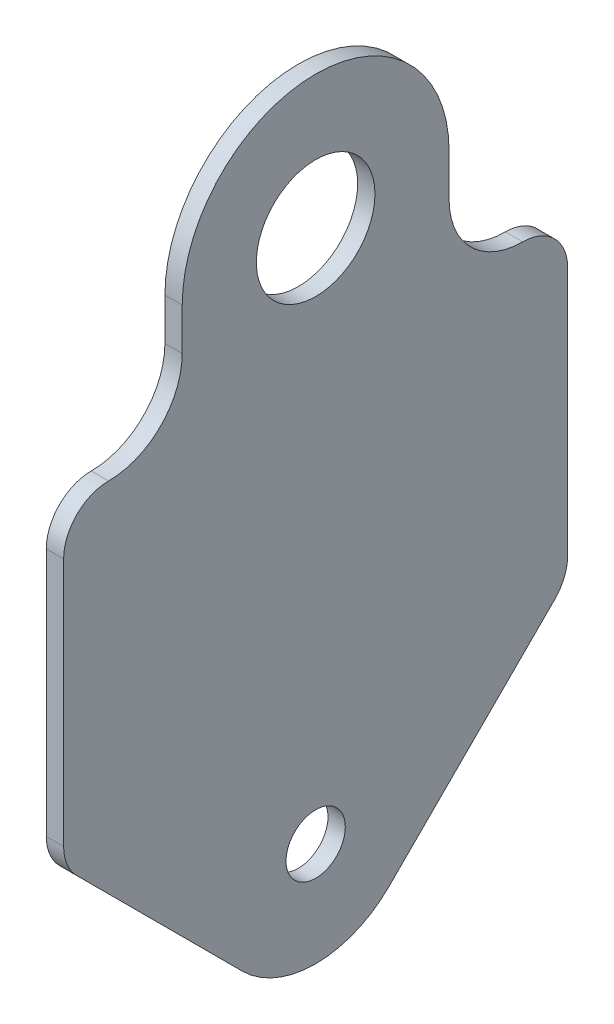
ISO-10303-21;
HEADER;
FILE_DESCRIPTION(('STEP AP214'),'2;1');
FILE_NAME('part.step','',(''),(''),'','','');
FILE_SCHEMA(('AUTOMOTIVE_DESIGN { 1 0 10303 214 1 1 1 1 }'));
ENDSEC;
DATA;
#1=APPLICATION_CONTEXT('core data for automotive mechanical design processes');
#2=APPLICATION_PROTOCOL_DEFINITION('international standard','automotive_design',2000,#1);
#3=PRODUCT_CONTEXT('',#1,'mechanical');
#4=PRODUCT('Part','Part','',(#3));
#5=PRODUCT_RELATED_PRODUCT_CATEGORY('part','',(#4));
#6=PRODUCT_DEFINITION_FORMATION('','',#4);
#7=PRODUCT_DEFINITION_CONTEXT('part definition',#1,'design');
#8=PRODUCT_DEFINITION('design','',#6,#7);
#9=PRODUCT_DEFINITION_SHAPE('','',#8);
#10=(LENGTH_UNIT() NAMED_UNIT(*) SI_UNIT(.MILLI.,.METRE.));
#11=(NAMED_UNIT(*) PLANE_ANGLE_UNIT() SI_UNIT($,.RADIAN.));
#12=(NAMED_UNIT(*) SI_UNIT($,.STERADIAN.) SOLID_ANGLE_UNIT());
#13=UNCERTAINTY_MEASURE_WITH_UNIT(LENGTH_MEASURE(1.E-05),#10,'distance_accuracy_value','');
#14=(GEOMETRIC_REPRESENTATION_CONTEXT(3) GLOBAL_UNCERTAINTY_ASSIGNED_CONTEXT((#13)) GLOBAL_UNIT_ASSIGNED_CONTEXT((#10,
#11,#12)) REPRESENTATION_CONTEXT('',''));
#15=CARTESIAN_POINT('',(0.,0.,0.));
#16=DIRECTION('',(0.,0.,1.));
#17=DIRECTION('',(1.,0.,0.));
#18=AXIS2_PLACEMENT_3D('',#15,#16,#17);
#19=CARTESIAN_POINT('',(2.3368,0.,0.));
#20=DIRECTION('',(-1.,0.,0.));
#21=DIRECTION('',(0.,0.,1.));
#22=AXIS2_PLACEMENT_3D('',#19,#20,#21);
#23=PLANE('',#22);
#24=CARTESIAN_POINT('',(2.3368,0.,0.));
#25=DIRECTION('',(1.,0.,0.));
#26=DIRECTION('',(0.,0.,1.));
#27=AXIS2_PLACEMENT_3D('',#24,#25,#26);
#28=CIRCLE('',#27,18.);
#29=CARTESIAN_POINT('',(2.3368,0.,-18.));
#30=VERTEX_POINT('',#29);
#31=CARTESIAN_POINT('',(2.3368,0.,18.));
#32=VERTEX_POINT('',#31);
#33=EDGE_CURVE('E193',#30,#32,#28,.T.);
#34=ORIENTED_EDGE('',*,*,#33,.T.);
#35=DIRECTION('',(0.,-1.,0.));
#36=VECTOR('',#35,1.);
#37=CARTESIAN_POINT('',(2.3368,0.,18.));
#38=LINE('',#37,#36);
#39=CARTESIAN_POINT('',(2.3368,-5.64053844801724,18.));
#40=VERTEX_POINT('',#39);
#41=EDGE_CURVE('E111',#32,#40,#38,.T.);
#42=ORIENTED_EDGE('',*,*,#41,.T.);
#43=CARTESIAN_POINT('',(2.3368,-5.64053844801724,27.9362546884231));
#44=DIRECTION('',(-1.,0.,0.));
#45=DIRECTION('',(0.,0.,-1.));
#46=AXIS2_PLACEMENT_3D('',#43,#44,#45);
#47=CIRCLE('',#46,9.93625468842306);
#48=CARTESIAN_POINT('',(2.3368,-15.5767931364403,27.9362546884231));
#49=VERTEX_POINT('',#48);
#50=EDGE_CURVE('E226',#40,#49,#47,.T.);
#51=ORIENTED_EDGE('',*,*,#50,.T.);
#52=CARTESIAN_POINT('',(2.3368,-21.6405384480172,27.9362546884231));
#53=DIRECTION('',(1.,0.,0.));
#54=DIRECTION('',(0.,0.,-1.));
#55=AXIS2_PLACEMENT_3D('',#52,#53,#54);
#56=CIRCLE('',#55,6.06374531157695);
#57=CARTESIAN_POINT('',(2.3368,-21.6405384480172,34.));
#58=VERTEX_POINT('',#57);
#59=EDGE_CURVE('E245',#49,#58,#56,.T.);
#60=ORIENTED_EDGE('',*,*,#59,.T.);
#61=DIRECTION('',(0.,-1.,0.));
#62=VECTOR('',#61,1.);
#63=CARTESIAN_POINT('',(2.3368,-21.6405384480172,34.));
#64=LINE('',#63,#62);
#65=CARTESIAN_POINT('',(2.3368,-55.2473043263916,34.));
#66=VERTEX_POINT('',#65);
#67=EDGE_CURVE('E242',#58,#66,#64,.T.);
#68=ORIENTED_EDGE('',*,*,#67,.T.);
#69=CARTESIAN_POINT('',(2.3368,-55.2473043263916,27.9362546884231));
#70=DIRECTION('',(1.,0.,0.));
#71=DIRECTION('',(0.,0.,-1.));
#72=AXIS2_PLACEMENT_3D('',#69,#70,#71);
#73=CIRCLE('',#72,6.06374531157696);
#74=CARTESIAN_POINT('',(2.3368,-59.5350197555958,32.2239701176273));
#75=VERTEX_POINT('',#74);
#76=EDGE_CURVE('E244',#66,#75,#73,.T.);
#77=ORIENTED_EDGE('',*,*,#76,.T.);
#78=DIRECTION('',(0.,-0.707106781186551,-0.707106781186544));
#79=VECTOR('',#78,1.);
#80=CARTESIAN_POINT('',(2.3368,-59.5350197555958,32.2239701176273));
#81=LINE('',#80,#79);
#82=CARTESIAN_POINT('',(2.3368,-81.8594949366116,9.89949493661172));
#83=VERTEX_POINT('',#82);
#84=EDGE_CURVE('E247',#75,#83,#81,.T.);
#85=ORIENTED_EDGE('',*,*,#84,.T.);
#86=CARTESIAN_POINT('',(2.3368,-71.96,0.));
#87=DIRECTION('',(1.,0.,0.));
#88=DIRECTION('',(0.,0.,-1.));
#89=AXIS2_PLACEMENT_3D('',#86,#87,#88);
#90=CIRCLE('',#89,14.);
#91=CARTESIAN_POINT('',(2.3368,-81.8594949366116,-9.89949493661172));
#92=VERTEX_POINT('',#91);
#93=EDGE_CURVE('E253',#83,#92,#90,.T.);
#94=ORIENTED_EDGE('',*,*,#93,.T.);
#95=DIRECTION('',(0.,0.707106781186551,-0.707106781186543));
#96=VECTOR('',#95,1.);
#97=CARTESIAN_POINT('',(2.3368,-81.8594949366116,-9.89949493661171));
#98=LINE('',#97,#96);
#99=CARTESIAN_POINT('',(2.3368,-59.5350197555958,-32.2239701176273));
#100=VERTEX_POINT('',#99);
#101=EDGE_CURVE('E255',#92,#100,#98,.T.);
#102=ORIENTED_EDGE('',*,*,#101,.T.);
#103=CARTESIAN_POINT('',(2.3368,-55.2473043263916,-27.9362546884231));
#104=DIRECTION('',(1.,0.,0.));
#105=DIRECTION('',(0.,0.,1.));
#106=AXIS2_PLACEMENT_3D('',#103,#104,#105);
#107=CIRCLE('',#106,6.06374531157695);
#108=CARTESIAN_POINT('',(2.3368,-55.2473043263916,-34.));
#109=VERTEX_POINT('',#108);
#110=EDGE_CURVE('E257',#100,#109,#107,.T.);
#111=ORIENTED_EDGE('',*,*,#110,.T.);
#112=DIRECTION('',(0.,1.,0.));
#113=VECTOR('',#112,1.);
#114=CARTESIAN_POINT('',(2.3368,-21.6405384480172,-34.));
#115=LINE('',#114,#113);
#116=CARTESIAN_POINT('',(2.3368,-21.6405384480172,-34.));
#117=VERTEX_POINT('',#116);
#118=EDGE_CURVE('E148',#109,#117,#115,.T.);
#119=ORIENTED_EDGE('',*,*,#118,.T.);
#120=CARTESIAN_POINT('',(2.3368,-21.6405384480172,-27.936254688423));
#121=DIRECTION('',(1.,0.,0.));
#122=DIRECTION('',(0.,0.,1.));
#123=AXIS2_PLACEMENT_3D('',#120,#121,#122);
#124=CIRCLE('',#123,6.06374531157695);
#125=CARTESIAN_POINT('',(2.3368,-15.5767931364403,-27.936254688423));
#126=VERTEX_POINT('',#125);
#127=EDGE_CURVE('E142',#117,#126,#124,.T.);
#128=ORIENTED_EDGE('',*,*,#127,.T.);
#129=CARTESIAN_POINT('',(2.3368,-5.64053844801724,-27.936254688423));
#130=DIRECTION('',(-1.,0.,0.));
#131=DIRECTION('',(0.,0.,-1.));
#132=AXIS2_PLACEMENT_3D('',#129,#130,#131);
#133=CIRCLE('',#132,9.93625468842306);
#134=CARTESIAN_POINT('',(2.3368,-5.64053844801724,-18.));
#135=VERTEX_POINT('',#134);
#136=EDGE_CURVE('E146',#126,#135,#133,.T.);
#137=ORIENTED_EDGE('',*,*,#136,.T.);
#138=DIRECTION('',(0.,1.,0.));
#139=VECTOR('',#138,1.);
#140=CARTESIAN_POINT('',(2.3368,0.,-18.));
#141=LINE('',#140,#139);
#142=EDGE_CURVE('E50',#135,#30,#141,.T.);
#143=ORIENTED_EDGE('',*,*,#142,.T.);
#144=EDGE_LOOP('',(#34,#42,#51,#60,#68,#77,#85,#94,#102,#111,#119,#128,#137,#143));
#145=FACE_BOUND('',#144,.T.);
#146=CARTESIAN_POINT('',(2.3368,0.,0.));
#147=DIRECTION('',(1.,0.,0.));
#148=DIRECTION('',(0.,0.,-1.));
#149=AXIS2_PLACEMENT_3D('',#146,#147,#148);
#150=CIRCLE('',#149,8.);
#151=CARTESIAN_POINT('',(2.3368,0.,-8.));
#152=VERTEX_POINT('',#151);
#153=EDGE_CURVE('E170',#152,#152,#150,.T.);
#154=ORIENTED_EDGE('',*,*,#153,.F.);
#155=EDGE_LOOP('',(#154));
#156=FACE_BOUND('',#155,.T.);
#157=CARTESIAN_POINT('',(2.3368,-71.96,0.));
#158=DIRECTION('',(1.,0.,0.));
#159=DIRECTION('',(0.,0.,-1.));
#160=AXIS2_PLACEMENT_3D('',#157,#158,#159);
#161=CIRCLE('',#160,4.);
#162=CARTESIAN_POINT('',(2.3368,-71.96,-4.00000000000001));
#163=VERTEX_POINT('',#162);
#164=EDGE_CURVE('E298',#163,#163,#161,.T.);
#165=ORIENTED_EDGE('',*,*,#164,.F.);
#166=EDGE_LOOP('',(#165));
#167=FACE_BOUND('',#166,.T.);
#168=ADVANCED_FACE('F33',(#145,#156,#167),#23,.F.);
#169=CARTESIAN_POINT('',(0.,0.,0.));
#170=DIRECTION('',(-1.,0.,0.));
#171=DIRECTION('',(0.,0.,1.));
#172=AXIS2_PLACEMENT_3D('',#169,#170,#171);
#173=PLANE('',#172);
#174=CARTESIAN_POINT('',(0.,0.,0.));
#175=DIRECTION('',(1.,0.,0.));
#176=DIRECTION('',(0.,0.,-1.));
#177=AXIS2_PLACEMENT_3D('',#174,#175,#176);
#178=CIRCLE('',#177,8.);
#179=CARTESIAN_POINT('',(0.,0.,-8.));
#180=VERTEX_POINT('',#179);
#181=EDGE_CURVE('E303',#180,#180,#178,.T.);
#182=ORIENTED_EDGE('',*,*,#181,.T.);
#183=EDGE_LOOP('',(#182));
#184=FACE_BOUND('',#183,.T.);
#185=CARTESIAN_POINT('',(0.,0.,0.));
#186=DIRECTION('',(1.,0.,0.));
#187=DIRECTION('',(0.,0.,1.));
#188=AXIS2_PLACEMENT_3D('',#185,#186,#187);
#189=CIRCLE('',#188,18.);
#190=CARTESIAN_POINT('',(0.,0.,-18.));
#191=VERTEX_POINT('',#190);
#192=CARTESIAN_POINT('',(0.,0.,18.));
#193=VERTEX_POINT('',#192);
#194=EDGE_CURVE('E166',#191,#193,#189,.T.);
#195=ORIENTED_EDGE('',*,*,#194,.F.);
#196=DIRECTION('',(0.,1.,0.));
#197=VECTOR('',#196,1.);
#198=CARTESIAN_POINT('',(0.,0.,-18.));
#199=LINE('',#198,#197);
#200=CARTESIAN_POINT('',(0.,-5.64053844801724,-18.));
#201=VERTEX_POINT('',#200);
#202=EDGE_CURVE('E103',#201,#191,#199,.T.);
#203=ORIENTED_EDGE('',*,*,#202,.F.);
#204=CARTESIAN_POINT('',(0.,-5.64053844801724,-27.936254688423));
#205=DIRECTION('',(-1.,0.,0.));
#206=DIRECTION('',(0.,0.,-1.));
#207=AXIS2_PLACEMENT_3D('',#204,#205,#206);
#208=CIRCLE('',#207,9.93625468842306);
#209=CARTESIAN_POINT('',(0.,-15.5767931364403,-27.936254688423));
#210=VERTEX_POINT('',#209);
#211=EDGE_CURVE('E97',#210,#201,#208,.T.);
#212=ORIENTED_EDGE('',*,*,#211,.F.);
#213=CARTESIAN_POINT('',(0.,-21.6405384480172,-27.936254688423));
#214=DIRECTION('',(1.,0.,0.));
#215=DIRECTION('',(0.,0.,1.));
#216=AXIS2_PLACEMENT_3D('',#213,#214,#215);
#217=CIRCLE('',#216,6.06374531157695);
#218=CARTESIAN_POINT('',(0.,-21.6405384480172,-34.));
#219=VERTEX_POINT('',#218);
#220=EDGE_CURVE('E156',#219,#210,#217,.T.);
#221=ORIENTED_EDGE('',*,*,#220,.F.);
#222=DIRECTION('',(0.,1.,0.));
#223=VECTOR('',#222,1.);
#224=CARTESIAN_POINT('',(0.,-21.6405384480172,-34.));
#225=LINE('',#224,#223);
#226=CARTESIAN_POINT('',(0.,-55.2473043263916,-34.));
#227=VERTEX_POINT('',#226);
#228=EDGE_CURVE('E188',#227,#219,#225,.T.);
#229=ORIENTED_EDGE('',*,*,#228,.F.);
#230=CARTESIAN_POINT('',(0.,-55.2473043263916,-27.9362546884231));
#231=DIRECTION('',(1.,0.,0.));
#232=DIRECTION('',(0.,0.,1.));
#233=AXIS2_PLACEMENT_3D('',#230,#231,#232);
#234=CIRCLE('',#233,6.06374531157695);
#235=CARTESIAN_POINT('',(0.,-59.5350197555958,-32.2239701176273));
#236=VERTEX_POINT('',#235);
#237=EDGE_CURVE('E186',#236,#227,#234,.T.);
#238=ORIENTED_EDGE('',*,*,#237,.F.);
#239=DIRECTION('',(0.,0.707106781186551,-0.707106781186543));
#240=VECTOR('',#239,1.);
#241=CARTESIAN_POINT('',(0.,-81.8594949366116,-9.89949493661171));
#242=LINE('',#241,#240);
#243=CARTESIAN_POINT('',(0.,-81.8594949366116,-9.89949493661172));
#244=VERTEX_POINT('',#243);
#245=EDGE_CURVE('E184',#244,#236,#242,.T.);
#246=ORIENTED_EDGE('',*,*,#245,.F.);
#247=CARTESIAN_POINT('',(0.,-71.96,0.));
#248=DIRECTION('',(1.,0.,0.));
#249=DIRECTION('',(0.,0.,-1.));
#250=AXIS2_PLACEMENT_3D('',#247,#248,#249);
#251=CIRCLE('',#250,14.);
#252=CARTESIAN_POINT('',(0.,-81.8594949366116,9.89949493661172));
#253=VERTEX_POINT('',#252);
#254=EDGE_CURVE('E182',#253,#244,#251,.T.);
#255=ORIENTED_EDGE('',*,*,#254,.F.);
#256=DIRECTION('',(0.,-0.707106781186551,-0.707106781186544));
#257=VECTOR('',#256,1.);
#258=CARTESIAN_POINT('',(0.,-59.5350197555958,32.2239701176273));
#259=LINE('',#258,#257);
#260=CARTESIAN_POINT('',(0.,-59.5350197555958,32.2239701176273));
#261=VERTEX_POINT('',#260);
#262=EDGE_CURVE('E180',#261,#253,#259,.T.);
#263=ORIENTED_EDGE('',*,*,#262,.F.);
#264=CARTESIAN_POINT('',(0.,-55.2473043263916,27.9362546884231));
#265=DIRECTION('',(1.,0.,0.));
#266=DIRECTION('',(0.,0.,-1.));
#267=AXIS2_PLACEMENT_3D('',#264,#265,#266);
#268=CIRCLE('',#267,6.06374531157696);
#269=CARTESIAN_POINT('',(0.,-55.2473043263916,34.));
#270=VERTEX_POINT('',#269);
#271=EDGE_CURVE('E178',#270,#261,#268,.T.);
#272=ORIENTED_EDGE('',*,*,#271,.F.);
#273=DIRECTION('',(0.,-1.,0.));
#274=VECTOR('',#273,1.);
#275=CARTESIAN_POINT('',(0.,-21.6405384480172,34.));
#276=LINE('',#275,#274);
#277=CARTESIAN_POINT('',(0.,-21.6405384480172,34.));
#278=VERTEX_POINT('',#277);
#279=EDGE_CURVE('E176',#278,#270,#276,.T.);
#280=ORIENTED_EDGE('',*,*,#279,.F.);
#281=CARTESIAN_POINT('',(0.,-21.6405384480172,27.9362546884231));
#282=DIRECTION('',(1.,0.,0.));
#283=DIRECTION('',(0.,0.,-1.));
#284=AXIS2_PLACEMENT_3D('',#281,#282,#283);
#285=CIRCLE('',#284,6.06374531157695);
#286=CARTESIAN_POINT('',(0.,-15.5767931364403,27.9362546884231));
#287=VERTEX_POINT('',#286);
#288=EDGE_CURVE('E174',#287,#278,#285,.T.);
#289=ORIENTED_EDGE('',*,*,#288,.F.);
#290=CARTESIAN_POINT('',(0.,-5.64053844801724,27.9362546884231));
#291=DIRECTION('',(-1.,0.,0.));
#292=DIRECTION('',(0.,0.,-1.));
#293=AXIS2_PLACEMENT_3D('',#290,#291,#292);
#294=CIRCLE('',#293,9.93625468842306);
#295=CARTESIAN_POINT('',(0.,-5.64053844801724,18.));
#296=VERTEX_POINT('',#295);
#297=EDGE_CURVE('E172',#296,#287,#294,.T.);
#298=ORIENTED_EDGE('',*,*,#297,.F.);
#299=DIRECTION('',(0.,-1.,0.));
#300=VECTOR('',#299,1.);
#301=CARTESIAN_POINT('',(0.,0.,18.));
#302=LINE('',#301,#300);
#303=EDGE_CURVE('E169',#193,#296,#302,.T.);
#304=ORIENTED_EDGE('',*,*,#303,.F.);
#305=EDGE_LOOP('',(#195,#203,#212,#221,#229,#238,#246,#255,#263,#272,#280,#289,#298,#304));
#306=FACE_BOUND('',#305,.T.);
#307=CARTESIAN_POINT('',(0.,-71.96,0.));
#308=DIRECTION('',(1.,0.,0.));
#309=DIRECTION('',(0.,0.,-1.));
#310=AXIS2_PLACEMENT_3D('',#307,#308,#309);
#311=CIRCLE('',#310,4.);
#312=CARTESIAN_POINT('',(0.,-71.96,-4.00000000000001));
#313=VERTEX_POINT('',#312);
#314=EDGE_CURVE('E301',#313,#313,#311,.T.);
#315=ORIENTED_EDGE('',*,*,#314,.T.);
#316=EDGE_LOOP('',(#315));
#317=FACE_BOUND('',#316,.T.);
#318=ADVANCED_FACE('F230',(#184,#306,#317),#173,.T.);
#319=CARTESIAN_POINT('',(2.3368,0.,0.));
#320=DIRECTION('',(-1.,0.,0.));
#321=DIRECTION('',(0.,0.,1.));
#322=AXIS2_PLACEMENT_3D('',#319,#320,#321);
#323=CYLINDRICAL_SURFACE('',#322,18.);
#324=ORIENTED_EDGE('',*,*,#194,.T.);
#325=DIRECTION('',(-1.,0.,0.));
#326=VECTOR('',#325,1.);
#327=CARTESIAN_POINT('',(2.3368,0.,18.));
#328=LINE('',#327,#326);
#329=EDGE_CURVE('E11',#32,#193,#328,.T.);
#330=ORIENTED_EDGE('',*,*,#329,.F.);
#331=ORIENTED_EDGE('',*,*,#33,.F.);
#332=DIRECTION('',(-1.,0.,0.));
#333=VECTOR('',#332,1.);
#334=CARTESIAN_POINT('',(2.3368,0.,-18.));
#335=LINE('',#334,#333);
#336=EDGE_CURVE('E162',#30,#191,#335,.T.);
#337=ORIENTED_EDGE('',*,*,#336,.T.);
#338=EDGE_LOOP('',(#324,#330,#331,#337));
#339=FACE_BOUND('',#338,.T.);
#340=ADVANCED_FACE('F35',(#339),#323,.T.);
#341=CARTESIAN_POINT('',(2.3368,0.,18.));
#342=DIRECTION('',(0.,0.,-1.));
#343=DIRECTION('',(0.,1.,0.));
#344=AXIS2_PLACEMENT_3D('',#341,#342,#343);
#345=PLANE('',#344);
#346=ORIENTED_EDGE('',*,*,#303,.T.);
#347=DIRECTION('',(-1.,0.,0.));
#348=VECTOR('',#347,1.);
#349=CARTESIAN_POINT('',(2.3368,-5.64053844801724,18.));
#350=LINE('',#349,#348);
#351=EDGE_CURVE('E42',#40,#296,#350,.T.);
#352=ORIENTED_EDGE('',*,*,#351,.F.);
#353=ORIENTED_EDGE('',*,*,#41,.F.);
#354=ORIENTED_EDGE('',*,*,#329,.T.);
#355=EDGE_LOOP('',(#346,#352,#353,#354));
#356=FACE_BOUND('',#355,.T.);
#357=ADVANCED_FACE('F418',(#356),#345,.F.);
#358=CARTESIAN_POINT('',(2.3368,-5.64053844801724,27.9362546884231));
#359=DIRECTION('',(-1.,0.,0.));
#360=DIRECTION('',(0.,0.,1.));
#361=AXIS2_PLACEMENT_3D('',#358,#359,#360);
#362=CYLINDRICAL_SURFACE('',#361,9.93625468842306);
#363=ORIENTED_EDGE('',*,*,#297,.T.);
#364=DIRECTION('',(-1.,0.,0.));
#365=VECTOR('',#364,1.);
#366=CARTESIAN_POINT('',(2.3368,-15.5767931364403,27.9362546884231));
#367=LINE('',#366,#365);
#368=EDGE_CURVE('E218',#49,#287,#367,.T.);
#369=ORIENTED_EDGE('',*,*,#368,.F.);
#370=ORIENTED_EDGE('',*,*,#50,.F.);
#371=ORIENTED_EDGE('',*,*,#351,.T.);
#372=EDGE_LOOP('',(#363,#369,#370,#371));
#373=FACE_BOUND('',#372,.T.);
#374=ADVANCED_FACE('F224',(#373),#362,.F.);
#375=CARTESIAN_POINT('',(2.3368,-21.6405384480172,27.9362546884231));
#376=DIRECTION('',(-1.,0.,0.));
#377=DIRECTION('',(0.,0.,1.));
#378=AXIS2_PLACEMENT_3D('',#375,#376,#377);
#379=CYLINDRICAL_SURFACE('',#378,6.06374531157695);
#380=ORIENTED_EDGE('',*,*,#288,.T.);
#381=DIRECTION('',(-1.,0.,0.));
#382=VECTOR('',#381,1.);
#383=CARTESIAN_POINT('',(2.3368,-21.6405384480172,34.));
#384=LINE('',#383,#382);
#385=EDGE_CURVE('E215',#58,#278,#384,.T.);
#386=ORIENTED_EDGE('',*,*,#385,.F.);
#387=ORIENTED_EDGE('',*,*,#59,.F.);
#388=ORIENTED_EDGE('',*,*,#368,.T.);
#389=EDGE_LOOP('',(#380,#386,#387,#388));
#390=FACE_BOUND('',#389,.T.);
#391=ADVANCED_FACE('F236',(#390),#379,.T.);
#392=CARTESIAN_POINT('',(2.3368,-21.6405384480172,34.));
#393=DIRECTION('',(0.,0.,-1.));
#394=DIRECTION('',(0.,1.,0.));
#395=AXIS2_PLACEMENT_3D('',#392,#393,#394);
#396=PLANE('',#395);
#397=ORIENTED_EDGE('',*,*,#279,.T.);
#398=DIRECTION('',(-1.,0.,0.));
#399=VECTOR('',#398,1.);
#400=CARTESIAN_POINT('',(2.3368,-55.2473043263916,34.));
#401=LINE('',#400,#399);
#402=EDGE_CURVE('E212',#66,#270,#401,.T.);
#403=ORIENTED_EDGE('',*,*,#402,.F.);
#404=ORIENTED_EDGE('',*,*,#67,.F.);
#405=ORIENTED_EDGE('',*,*,#385,.T.);
#406=EDGE_LOOP('',(#397,#403,#404,#405));
#407=FACE_BOUND('',#406,.T.);
#408=ADVANCED_FACE('F240',(#407),#396,.F.);
#409=CARTESIAN_POINT('',(2.3368,-55.2473043263916,27.9362546884231));
#410=DIRECTION('',(-1.,0.,0.));
#411=DIRECTION('',(0.,0.,1.));
#412=AXIS2_PLACEMENT_3D('',#409,#410,#411);
#413=CYLINDRICAL_SURFACE('',#412,6.06374531157696);
#414=ORIENTED_EDGE('',*,*,#271,.T.);
#415=DIRECTION('',(-1.,0.,0.));
#416=VECTOR('',#415,1.);
#417=CARTESIAN_POINT('',(2.3368,-59.5350197555958,32.2239701176273));
#418=LINE('',#417,#416);
#419=EDGE_CURVE('E209',#75,#261,#418,.T.);
#420=ORIENTED_EDGE('',*,*,#419,.F.);
#421=ORIENTED_EDGE('',*,*,#76,.F.);
#422=ORIENTED_EDGE('',*,*,#402,.T.);
#423=EDGE_LOOP('',(#414,#420,#421,#422));
#424=FACE_BOUND('',#423,.T.);
#425=ADVANCED_FACE('F383',(#424),#413,.T.);
#426=CARTESIAN_POINT('',(2.3368,-59.5350197555958,32.2239701176273));
#427=DIRECTION('',(0.,0.707106781186544,-0.707106781186551));
#428=DIRECTION('',(0.,0.707106781186551,0.707106781186544));
#429=AXIS2_PLACEMENT_3D('',#426,#427,#428);
#430=PLANE('',#429);
#431=ORIENTED_EDGE('',*,*,#262,.T.);
#432=DIRECTION('',(-1.,0.,0.));
#433=VECTOR('',#432,1.);
#434=CARTESIAN_POINT('',(2.3368,-81.8594949366116,9.89949493661172));
#435=LINE('',#434,#433);
#436=EDGE_CURVE('E206',#83,#253,#435,.T.);
#437=ORIENTED_EDGE('',*,*,#436,.F.);
#438=ORIENTED_EDGE('',*,*,#84,.F.);
#439=ORIENTED_EDGE('',*,*,#419,.T.);
#440=EDGE_LOOP('',(#431,#437,#438,#439));
#441=FACE_BOUND('',#440,.T.);
#442=ADVANCED_FACE('F373',(#441),#430,.F.);
#443=CARTESIAN_POINT('',(2.3368,-71.96,0.));
#444=DIRECTION('',(-1.,0.,0.));
#445=DIRECTION('',(0.,0.,1.));
#446=AXIS2_PLACEMENT_3D('',#443,#444,#445);
#447=CYLINDRICAL_SURFACE('',#446,14.);
#448=ORIENTED_EDGE('',*,*,#254,.T.);
#449=DIRECTION('',(-1.,0.,0.));
#450=VECTOR('',#449,1.);
#451=CARTESIAN_POINT('',(2.3368,-81.8594949366116,-9.89949493661172));
#452=LINE('',#451,#450);
#453=EDGE_CURVE('E203',#92,#244,#452,.T.);
#454=ORIENTED_EDGE('',*,*,#453,.F.);
#455=ORIENTED_EDGE('',*,*,#93,.F.);
#456=ORIENTED_EDGE('',*,*,#436,.T.);
#457=EDGE_LOOP('',(#448,#454,#455,#456));
#458=FACE_BOUND('',#457,.T.);
#459=ADVANCED_FACE('F363',(#458),#447,.T.);
#460=CARTESIAN_POINT('',(2.3368,-81.8594949366116,-9.89949493661171));
#461=DIRECTION('',(0.,0.707106781186543,0.707106781186551));
#462=DIRECTION('',(0.,-0.707106781186552,0.707106781186544));
#463=AXIS2_PLACEMENT_3D('',#460,#461,#462);
#464=PLANE('',#463);
#465=ORIENTED_EDGE('',*,*,#245,.T.);
#466=DIRECTION('',(-1.,0.,0.));
#467=VECTOR('',#466,1.);
#468=CARTESIAN_POINT('',(2.3368,-59.5350197555958,-32.2239701176273));
#469=LINE('',#468,#467);
#470=EDGE_CURVE('E200',#100,#236,#469,.T.);
#471=ORIENTED_EDGE('',*,*,#470,.F.);
#472=ORIENTED_EDGE('',*,*,#101,.F.);
#473=ORIENTED_EDGE('',*,*,#453,.T.);
#474=EDGE_LOOP('',(#465,#471,#472,#473));
#475=FACE_BOUND('',#474,.T.);
#476=ADVANCED_FACE('F354',(#475),#464,.F.);
#477=CARTESIAN_POINT('',(2.3368,-55.2473043263916,-27.9362546884231));
#478=DIRECTION('',(-1.,0.,0.));
#479=DIRECTION('',(0.,0.,1.));
#480=AXIS2_PLACEMENT_3D('',#477,#478,#479);
#481=CYLINDRICAL_SURFACE('',#480,6.06374531157695);
#482=ORIENTED_EDGE('',*,*,#237,.T.);
#483=DIRECTION('',(-1.,0.,0.));
#484=VECTOR('',#483,1.);
#485=CARTESIAN_POINT('',(2.3368,-55.2473043263916,-34.));
#486=LINE('',#485,#484);
#487=EDGE_CURVE('E197',#109,#227,#486,.T.);
#488=ORIENTED_EDGE('',*,*,#487,.F.);
#489=ORIENTED_EDGE('',*,*,#110,.F.);
#490=ORIENTED_EDGE('',*,*,#470,.T.);
#491=EDGE_LOOP('',(#482,#488,#489,#490));
#492=FACE_BOUND('',#491,.T.);
#493=ADVANCED_FACE('F263',(#492),#481,.T.);
#494=CARTESIAN_POINT('',(2.3368,-21.6405384480172,-34.));
#495=DIRECTION('',(0.,0.,1.));
#496=DIRECTION('',(0.,-1.,0.));
#497=AXIS2_PLACEMENT_3D('',#494,#495,#496);
#498=PLANE('',#497);
#499=ORIENTED_EDGE('',*,*,#228,.T.);
#500=DIRECTION('',(-1.,0.,0.));
#501=VECTOR('',#500,1.);
#502=CARTESIAN_POINT('',(2.3368,-21.6405384480172,-34.));
#503=LINE('',#502,#501);
#504=EDGE_CURVE('E157',#117,#219,#503,.T.);
#505=ORIENTED_EDGE('',*,*,#504,.F.);
#506=ORIENTED_EDGE('',*,*,#118,.F.);
#507=ORIENTED_EDGE('',*,*,#487,.T.);
#508=EDGE_LOOP('',(#499,#505,#506,#507));
#509=FACE_BOUND('',#508,.T.);
#510=ADVANCED_FACE('F267',(#509),#498,.F.);
#511=CARTESIAN_POINT('',(2.3368,-21.6405384480172,-27.936254688423));
#512=DIRECTION('',(-1.,0.,0.));
#513=DIRECTION('',(0.,0.,1.));
#514=AXIS2_PLACEMENT_3D('',#511,#512,#513);
#515=CYLINDRICAL_SURFACE('',#514,6.06374531157695);
#516=ORIENTED_EDGE('',*,*,#220,.T.);
#517=DIRECTION('',(-1.,0.,0.));
#518=VECTOR('',#517,1.);
#519=CARTESIAN_POINT('',(2.3368,-15.5767931364403,-27.936254688423));
#520=LINE('',#519,#518);
#521=EDGE_CURVE('E153',#126,#210,#520,.T.);
#522=ORIENTED_EDGE('',*,*,#521,.F.);
#523=ORIENTED_EDGE('',*,*,#127,.F.);
#524=ORIENTED_EDGE('',*,*,#504,.T.);
#525=EDGE_LOOP('',(#516,#522,#523,#524));
#526=FACE_BOUND('',#525,.T.);
#527=ADVANCED_FACE('F154',(#526),#515,.T.);
#528=CARTESIAN_POINT('',(2.3368,-5.64053844801724,-27.936254688423));
#529=DIRECTION('',(-1.,0.,0.));
#530=DIRECTION('',(0.,0.,1.));
#531=AXIS2_PLACEMENT_3D('',#528,#529,#530);
#532=CYLINDRICAL_SURFACE('',#531,9.93625468842306);
#533=ORIENTED_EDGE('',*,*,#211,.T.);
#534=DIRECTION('',(-1.,0.,0.));
#535=VECTOR('',#534,1.);
#536=CARTESIAN_POINT('',(2.3368,-5.64053844801724,-18.));
#537=LINE('',#536,#535);
#538=EDGE_CURVE('E158',#135,#201,#537,.T.);
#539=ORIENTED_EDGE('',*,*,#538,.F.);
#540=ORIENTED_EDGE('',*,*,#136,.F.);
#541=ORIENTED_EDGE('',*,*,#521,.T.);
#542=EDGE_LOOP('',(#533,#539,#540,#541));
#543=FACE_BOUND('',#542,.T.);
#544=ADVANCED_FACE('F160',(#543),#532,.F.);
#545=CARTESIAN_POINT('',(2.3368,0.,-18.));
#546=DIRECTION('',(0.,0.,1.));
#547=DIRECTION('',(0.,-1.,0.));
#548=AXIS2_PLACEMENT_3D('',#545,#546,#547);
#549=PLANE('',#548);
#550=ORIENTED_EDGE('',*,*,#202,.T.);
#551=ORIENTED_EDGE('',*,*,#336,.F.);
#552=ORIENTED_EDGE('',*,*,#142,.F.);
#553=ORIENTED_EDGE('',*,*,#538,.T.);
#554=EDGE_LOOP('',(#550,#551,#552,#553));
#555=FACE_BOUND('',#554,.T.);
#556=ADVANCED_FACE('F271',(#555),#549,.F.);
#557=CARTESIAN_POINT('',(2.3368,0.,0.));
#558=DIRECTION('',(-1.,0.,0.));
#559=DIRECTION('',(0.,0.,1.));
#560=AXIS2_PLACEMENT_3D('',#557,#558,#559);
#561=CYLINDRICAL_SURFACE('',#560,8.);
#562=ORIENTED_EDGE('',*,*,#153,.T.);
#563=EDGE_LOOP('',(#562));
#564=FACE_BOUND('',#563,.T.);
#565=ORIENTED_EDGE('',*,*,#181,.F.);
#566=EDGE_LOOP('',(#565));
#567=FACE_BOUND('',#566,.T.);
#568=ADVANCED_FACE('F273',(#564,#567),#561,.F.);
#569=CARTESIAN_POINT('',(2.3368,-71.96,0.));
#570=DIRECTION('',(-1.,0.,0.));
#571=DIRECTION('',(0.,0.,1.));
#572=AXIS2_PLACEMENT_3D('',#569,#570,#571);
#573=CYLINDRICAL_SURFACE('',#572,4.);
#574=ORIENTED_EDGE('',*,*,#164,.T.);
#575=EDGE_LOOP('',(#574));
#576=FACE_BOUND('',#575,.T.);
#577=ORIENTED_EDGE('',*,*,#314,.F.);
#578=EDGE_LOOP('',(#577));
#579=FACE_BOUND('',#578,.T.);
#580=ADVANCED_FACE('F279',(#576,#579),#573,.F.);
#581=CLOSED_SHELL('',(#168,#318,#340,#357,#374,#391,#408,#425,#442,#459,#476,#493,#510,#527,
#544,#556,#568,#580));
#582=MANIFOLD_SOLID_BREP('B2',#581);
#583=ADVANCED_BREP_SHAPE_REPRESENTATION('',(#18,#582),#14);
#584=SHAPE_DEFINITION_REPRESENTATION(#9,#583);
ENDSEC;
END-ISO-10303-21;
